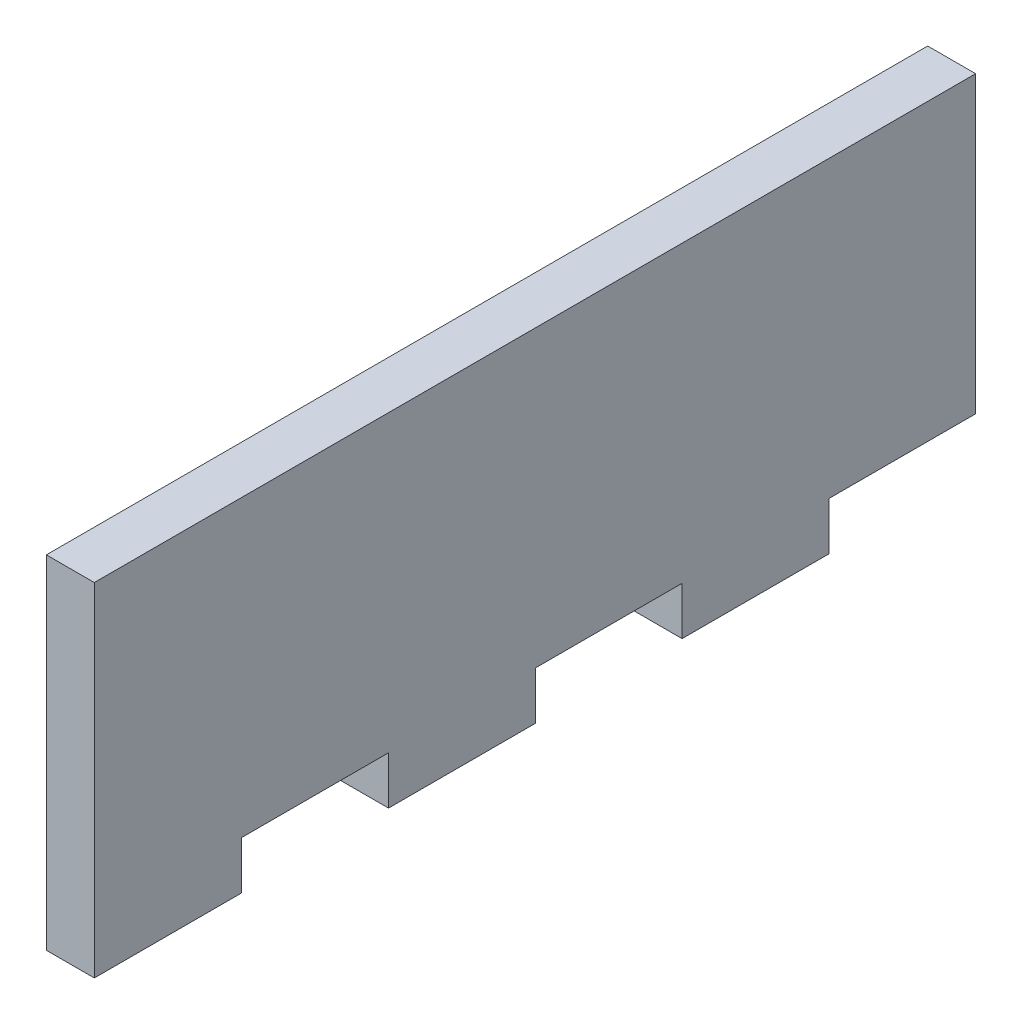
ISO-10303-21;
HEADER;
FILE_DESCRIPTION(('STEP AP214'),'2;1');
FILE_NAME('part.step','',(''),(''),'','','');
FILE_SCHEMA(('AUTOMOTIVE_DESIGN { 1 0 10303 214 1 1 1 1 }'));
ENDSEC;
DATA;
#1=APPLICATION_CONTEXT('core data for automotive mechanical design processes');
#2=APPLICATION_PROTOCOL_DEFINITION('international standard','automotive_design',2000,#1);
#3=PRODUCT_CONTEXT('',#1,'mechanical');
#4=PRODUCT('Part','Part','',(#3));
#5=PRODUCT_RELATED_PRODUCT_CATEGORY('part','',(#4));
#6=PRODUCT_DEFINITION_FORMATION('','',#4);
#7=PRODUCT_DEFINITION_CONTEXT('part definition',#1,'design');
#8=PRODUCT_DEFINITION('design','',#6,#7);
#9=PRODUCT_DEFINITION_SHAPE('','',#8);
#10=(LENGTH_UNIT() NAMED_UNIT(*) SI_UNIT(.MILLI.,.METRE.));
#11=(NAMED_UNIT(*) PLANE_ANGLE_UNIT() SI_UNIT($,.RADIAN.));
#12=(NAMED_UNIT(*) SI_UNIT($,.STERADIAN.) SOLID_ANGLE_UNIT());
#13=UNCERTAINTY_MEASURE_WITH_UNIT(LENGTH_MEASURE(1.E-05),#10,'distance_accuracy_value','');
#14=(GEOMETRIC_REPRESENTATION_CONTEXT(3) GLOBAL_UNCERTAINTY_ASSIGNED_CONTEXT((#13)) GLOBAL_UNIT_ASSIGNED_CONTEXT((#10,
#11,#12)) REPRESENTATION_CONTEXT('',''));
#15=CARTESIAN_POINT('',(0.,0.,0.));
#16=DIRECTION('',(0.,0.,1.));
#17=DIRECTION('',(1.,0.,0.));
#18=AXIS2_PLACEMENT_3D('',#15,#16,#17);
#19=CARTESIAN_POINT('',(5.334,-19.05,57.15));
#20=DIRECTION('',(0.,1.,0.));
#21=DIRECTION('',(0.,0.,1.));
#22=AXIS2_PLACEMENT_3D('',#19,#20,#21);
#23=PLANE('',#22);
#24=DIRECTION('',(1.,0.,0.));
#25=VECTOR('',#24,1.);
#26=CARTESIAN_POINT('',(0.,-19.05,40.7488571428571));
#27=LINE('',#26,#25);
#28=CARTESIAN_POINT('',(0.,-19.05,40.7488571428571));
#29=VERTEX_POINT('',#28);
#30=CARTESIAN_POINT('',(5.33399999999999,-19.05,40.7488571428571));
#31=VERTEX_POINT('',#30);
#32=EDGE_CURVE('E211',#29,#31,#27,.T.);
#33=ORIENTED_EDGE('',*,*,#32,.T.);
#34=DIRECTION('',(0.,0.,-1.));
#35=VECTOR('',#34,1.);
#36=CARTESIAN_POINT('',(5.334,-19.05,57.15));
#37=LINE('',#36,#35);
#38=CARTESIAN_POINT('',(5.334,-19.05,57.15));
#39=VERTEX_POINT('',#38);
#40=EDGE_CURVE('E187',#39,#31,#37,.T.);
#41=ORIENTED_EDGE('',*,*,#40,.F.);
#42=DIRECTION('',(-1.,0.,0.));
#43=VECTOR('',#42,1.);
#44=CARTESIAN_POINT('',(5.334,-19.05,57.15));
#45=LINE('',#44,#43);
#46=CARTESIAN_POINT('',(0.,-19.05,57.15));
#47=VERTEX_POINT('',#46);
#48=EDGE_CURVE('E41',#39,#47,#45,.T.);
#49=ORIENTED_EDGE('',*,*,#48,.T.);
#50=DIRECTION('',(0.,0.,-1.));
#51=VECTOR('',#50,1.);
#52=CARTESIAN_POINT('',(0.,-19.05,57.15));
#53=LINE('',#52,#51);
#54=EDGE_CURVE('E184',#47,#29,#53,.T.);
#55=ORIENTED_EDGE('',*,*,#54,.T.);
#56=EDGE_LOOP('',(#33,#41,#49,#55));
#57=FACE_BOUND('',#56,.T.);
#58=ADVANCED_FACE('F33',(#57),#23,.F.);
#59=DIRECTION('',(-1.,0.,0.));
#60=VECTOR('',#59,1.);
#61=CARTESIAN_POINT('',(0.,-19.05,24.4202857142857));
#62=LINE('',#61,#60);
#63=CARTESIAN_POINT('',(5.33399999999999,-19.05,24.4202857142857));
#64=VERTEX_POINT('',#63);
#65=CARTESIAN_POINT('',(0.,-19.05,24.4202857142857));
#66=VERTEX_POINT('',#65);
#67=EDGE_CURVE('E230',#64,#66,#62,.T.);
#68=ORIENTED_EDGE('',*,*,#67,.T.);
#69=CARTESIAN_POINT('',(0.,-19.05,8.09171428571425));
#70=VERTEX_POINT('',#69);
#71=EDGE_CURVE('E195',#66,#70,#53,.T.);
#72=ORIENTED_EDGE('',*,*,#71,.T.);
#73=DIRECTION('',(1.,0.,0.));
#74=VECTOR('',#73,1.);
#75=CARTESIAN_POINT('',(0.,-19.05,8.09171428571425));
#76=LINE('',#75,#74);
#77=CARTESIAN_POINT('',(5.33399999999999,-19.05,8.09171428571425));
#78=VERTEX_POINT('',#77);
#79=EDGE_CURVE('E226',#70,#78,#76,.T.);
#80=ORIENTED_EDGE('',*,*,#79,.T.);
#81=EDGE_CURVE('E189',#64,#78,#37,.T.);
#82=ORIENTED_EDGE('',*,*,#81,.F.);
#83=EDGE_LOOP('',(#68,#72,#80,#82));
#84=FACE_BOUND('',#83,.T.);
#85=ADVANCED_FACE('F253',(#84),#23,.F.);
#86=DIRECTION('',(-1.,0.,0.));
#87=VECTOR('',#86,1.);
#88=CARTESIAN_POINT('',(0.,-19.05,-8.23685714285717));
#89=LINE('',#88,#87);
#90=CARTESIAN_POINT('',(5.33399999999998,-19.05,-8.23685714285718));
#91=VERTEX_POINT('',#90);
#92=CARTESIAN_POINT('',(0.,-19.05,-8.23685714285717));
#93=VERTEX_POINT('',#92);
#94=EDGE_CURVE('E242',#91,#93,#89,.T.);
#95=ORIENTED_EDGE('',*,*,#94,.T.);
#96=CARTESIAN_POINT('',(0.,-19.05,-24.5654285714286));
#97=VERTEX_POINT('',#96);
#98=EDGE_CURVE('E193',#93,#97,#53,.T.);
#99=ORIENTED_EDGE('',*,*,#98,.T.);
#100=DIRECTION('',(1.,0.,0.));
#101=VECTOR('',#100,1.);
#102=CARTESIAN_POINT('',(0.,-19.05,-24.5654285714286));
#103=LINE('',#102,#101);
#104=CARTESIAN_POINT('',(5.33399999999998,-19.05,-24.5654285714286));
#105=VERTEX_POINT('',#104);
#106=EDGE_CURVE('E152',#97,#105,#103,.T.);
#107=ORIENTED_EDGE('',*,*,#106,.T.);
#108=EDGE_CURVE('E186',#91,#105,#37,.T.);
#109=ORIENTED_EDGE('',*,*,#108,.F.);
#110=EDGE_LOOP('',(#95,#99,#107,#109));
#111=FACE_BOUND('',#110,.T.);
#112=ADVANCED_FACE('F266',(#111),#23,.F.);
#113=CARTESIAN_POINT('',(0.,19.05,-57.15));
#114=DIRECTION('',(-1.,0.,0.));
#115=DIRECTION('',(0.,0.,1.));
#116=AXIS2_PLACEMENT_3D('',#113,#114,#115);
#117=PLANE('',#116);
#118=DIRECTION('',(0.,0.,-1.));
#119=VECTOR('',#118,1.);
#120=CARTESIAN_POINT('',(0.,-13.716,-40.894));
#121=LINE('',#120,#119);
#122=CARTESIAN_POINT('',(0.,-13.716,40.7488571428571));
#123=VERTEX_POINT('',#122);
#124=CARTESIAN_POINT('',(0.,-13.716,24.4202857142857));
#125=VERTEX_POINT('',#124);
#126=EDGE_CURVE('E48',#123,#125,#121,.T.);
#127=ORIENTED_EDGE('',*,*,#126,.F.);
#128=DIRECTION('',(0.,-1.,0.));
#129=VECTOR('',#128,1.);
#130=CARTESIAN_POINT('',(0.,-13.716,40.7488571428571));
#131=LINE('',#130,#129);
#132=EDGE_CURVE('E165',#123,#29,#131,.T.);
#133=ORIENTED_EDGE('',*,*,#132,.T.);
#134=ORIENTED_EDGE('',*,*,#54,.F.);
#135=DIRECTION('',(0.,-1.,0.));
#136=VECTOR('',#135,1.);
#137=CARTESIAN_POINT('',(0.,-19.05,57.15));
#138=LINE('',#137,#136);
#139=CARTESIAN_POINT('',(0.,19.05,57.15));
#140=VERTEX_POINT('',#139);
#141=EDGE_CURVE('E191',#140,#47,#138,.T.);
#142=ORIENTED_EDGE('',*,*,#141,.F.);
#143=DIRECTION('',(0.,0.,1.));
#144=VECTOR('',#143,1.);
#145=CARTESIAN_POINT('',(0.,19.05,57.15));
#146=LINE('',#145,#144);
#147=CARTESIAN_POINT('',(0.,19.05,-40.894));
#148=VERTEX_POINT('',#147);
#149=EDGE_CURVE('E180',#148,#140,#146,.T.);
#150=ORIENTED_EDGE('',*,*,#149,.F.);
#151=DIRECTION('',(0.,-1.,0.));
#152=VECTOR('',#151,1.);
#153=CARTESIAN_POINT('',(0.,-19.05,-40.894));
#154=LINE('',#153,#152);
#155=CARTESIAN_POINT('',(0.,-13.716,-40.894));
#156=VERTEX_POINT('',#155);
#157=EDGE_CURVE('E161',#148,#156,#154,.T.);
#158=ORIENTED_EDGE('',*,*,#157,.T.);
#159=CARTESIAN_POINT('',(0.,-13.716,-24.5654285714286));
#160=VERTEX_POINT('',#159);
#161=EDGE_CURVE('E139',#160,#156,#121,.T.);
#162=ORIENTED_EDGE('',*,*,#161,.F.);
#163=DIRECTION('',(0.,-1.,0.));
#164=VECTOR('',#163,1.);
#165=CARTESIAN_POINT('',(0.,-13.716,-24.5654285714286));
#166=LINE('',#165,#164);
#167=EDGE_CURVE('E149',#160,#97,#166,.T.);
#168=ORIENTED_EDGE('',*,*,#167,.T.);
#169=ORIENTED_EDGE('',*,*,#98,.F.);
#170=DIRECTION('',(0.,-1.,0.));
#171=VECTOR('',#170,1.);
#172=CARTESIAN_POINT('',(0.,-13.716,-8.23685714285717));
#173=LINE('',#172,#171);
#174=CARTESIAN_POINT('',(0.,-13.716,-8.23685714285717));
#175=VERTEX_POINT('',#174);
#176=EDGE_CURVE('E145',#175,#93,#173,.T.);
#177=ORIENTED_EDGE('',*,*,#176,.F.);
#178=CARTESIAN_POINT('',(0.,-13.716,8.09171428571425));
#179=VERTEX_POINT('',#178);
#180=EDGE_CURVE('E56',#179,#175,#121,.T.);
#181=ORIENTED_EDGE('',*,*,#180,.F.);
#182=DIRECTION('',(0.,-1.,0.));
#183=VECTOR('',#182,1.);
#184=CARTESIAN_POINT('',(0.,-13.716,8.09171428571425));
#185=LINE('',#184,#183);
#186=EDGE_CURVE('E218',#179,#70,#185,.T.);
#187=ORIENTED_EDGE('',*,*,#186,.T.);
#188=ORIENTED_EDGE('',*,*,#71,.F.);
#189=DIRECTION('',(0.,-1.,0.));
#190=VECTOR('',#189,1.);
#191=CARTESIAN_POINT('',(0.,-13.716,24.4202857142857));
#192=LINE('',#191,#190);
#193=EDGE_CURVE('E216',#125,#66,#192,.T.);
#194=ORIENTED_EDGE('',*,*,#193,.F.);
#195=EDGE_LOOP('',(#127,#133,#134,#142,#150,#158,#162,#168,#169,#177,#181,#187,#188,#194));
#196=FACE_BOUND('',#195,.T.);
#197=ADVANCED_FACE('F159',(#196),#117,.T.);
#198=CARTESIAN_POINT('',(5.334,19.05,57.15));
#199=DIRECTION('',(0.,-1.,0.));
#200=DIRECTION('',(0.,0.,-1.));
#201=AXIS2_PLACEMENT_3D('',#198,#199,#200);
#202=PLANE('',#201);
#203=DIRECTION('',(0.,0.,1.));
#204=VECTOR('',#203,1.);
#205=CARTESIAN_POINT('',(5.334,19.05,57.15));
#206=LINE('',#205,#204);
#207=CARTESIAN_POINT('',(5.334,19.05,-40.894));
#208=VERTEX_POINT('',#207);
#209=CARTESIAN_POINT('',(5.334,19.05,57.15));
#210=VERTEX_POINT('',#209);
#211=EDGE_CURVE('E181',#208,#210,#206,.T.);
#212=ORIENTED_EDGE('',*,*,#211,.F.);
#213=DIRECTION('',(1.,0.,0.));
#214=VECTOR('',#213,1.);
#215=CARTESIAN_POINT('',(0.,19.05,-40.894));
#216=LINE('',#215,#214);
#217=EDGE_CURVE('E175',#148,#208,#216,.T.);
#218=ORIENTED_EDGE('',*,*,#217,.F.);
#219=ORIENTED_EDGE('',*,*,#149,.T.);
#220=DIRECTION('',(-1.,0.,0.));
#221=VECTOR('',#220,1.);
#222=CARTESIAN_POINT('',(5.334,19.05,57.15));
#223=LINE('',#222,#221);
#224=EDGE_CURVE('E11',#210,#140,#223,.T.);
#225=ORIENTED_EDGE('',*,*,#224,.F.);
#226=EDGE_LOOP('',(#212,#218,#219,#225));
#227=FACE_BOUND('',#226,.T.);
#228=ADVANCED_FACE('F35',(#227),#202,.F.);
#229=CARTESIAN_POINT('',(5.334,-19.05,57.15));
#230=DIRECTION('',(0.,0.,-1.));
#231=DIRECTION('',(-1.,0.,0.));
#232=AXIS2_PLACEMENT_3D('',#229,#230,#231);
#233=PLANE('',#232);
#234=ORIENTED_EDGE('',*,*,#141,.T.);
#235=ORIENTED_EDGE('',*,*,#48,.F.);
#236=DIRECTION('',(0.,-1.,0.));
#237=VECTOR('',#236,1.);
#238=CARTESIAN_POINT('',(5.334,-19.05,57.15));
#239=LINE('',#238,#237);
#240=EDGE_CURVE('E183',#210,#39,#239,.T.);
#241=ORIENTED_EDGE('',*,*,#240,.F.);
#242=ORIENTED_EDGE('',*,*,#224,.T.);
#243=EDGE_LOOP('',(#234,#235,#241,#242));
#244=FACE_BOUND('',#243,.T.);
#245=ADVANCED_FACE('F304',(#244),#233,.F.);
#246=CARTESIAN_POINT('',(5.334,19.05,-57.15));
#247=DIRECTION('',(-1.,0.,0.));
#248=DIRECTION('',(0.,0.,1.));
#249=AXIS2_PLACEMENT_3D('',#246,#247,#248);
#250=PLANE('',#249);
#251=DIRECTION('',(0.,-1.,0.));
#252=VECTOR('',#251,1.);
#253=CARTESIAN_POINT('',(5.33399999999999,-13.716,40.7488571428571));
#254=LINE('',#253,#252);
#255=CARTESIAN_POINT('',(5.334,-13.716,40.7488571428571));
#256=VERTEX_POINT('',#255);
#257=EDGE_CURVE('E162',#256,#31,#254,.T.);
#258=ORIENTED_EDGE('',*,*,#257,.F.);
#259=DIRECTION('',(0.,0.,-1.));
#260=VECTOR('',#259,1.);
#261=CARTESIAN_POINT('',(5.334,-13.716,-57.15));
#262=LINE('',#261,#260);
#263=CARTESIAN_POINT('',(5.33399999999999,-13.716,24.4202857142857));
#264=VERTEX_POINT('',#263);
#265=EDGE_CURVE('E172',#256,#264,#262,.T.);
#266=ORIENTED_EDGE('',*,*,#265,.T.);
#267=DIRECTION('',(0.,-1.,0.));
#268=VECTOR('',#267,1.);
#269=CARTESIAN_POINT('',(5.33399999999999,-13.716,24.4202857142857));
#270=LINE('',#269,#268);
#271=EDGE_CURVE('E214',#264,#64,#270,.T.);
#272=ORIENTED_EDGE('',*,*,#271,.T.);
#273=ORIENTED_EDGE('',*,*,#81,.T.);
#274=DIRECTION('',(0.,-1.,0.));
#275=VECTOR('',#274,1.);
#276=CARTESIAN_POINT('',(5.33399999999999,-13.716,8.09171428571425));
#277=LINE('',#276,#275);
#278=CARTESIAN_POINT('',(5.334,-13.716,8.09171428571425));
#279=VERTEX_POINT('',#278);
#280=EDGE_CURVE('E222',#279,#78,#277,.T.);
#281=ORIENTED_EDGE('',*,*,#280,.F.);
#282=CARTESIAN_POINT('',(5.33399999999999,-13.716,-8.23685714285718));
#283=VERTEX_POINT('',#282);
#284=EDGE_CURVE('E170',#279,#283,#262,.T.);
#285=ORIENTED_EDGE('',*,*,#284,.T.);
#286=DIRECTION('',(0.,-1.,0.));
#287=VECTOR('',#286,1.);
#288=CARTESIAN_POINT('',(5.33399999999999,-13.716,-8.23685714285718));
#289=LINE('',#288,#287);
#290=EDGE_CURVE('E233',#283,#91,#289,.T.);
#291=ORIENTED_EDGE('',*,*,#290,.T.);
#292=ORIENTED_EDGE('',*,*,#108,.T.);
#293=DIRECTION('',(0.,-1.,0.));
#294=VECTOR('',#293,1.);
#295=CARTESIAN_POINT('',(5.33399999999998,-13.716,-24.5654285714286));
#296=LINE('',#295,#294);
#297=CARTESIAN_POINT('',(5.33399999999999,-13.716,-24.5654285714286));
#298=VERTEX_POINT('',#297);
#299=EDGE_CURVE('E156',#298,#105,#296,.T.);
#300=ORIENTED_EDGE('',*,*,#299,.F.);
#301=CARTESIAN_POINT('',(5.334,-13.716,-40.894));
#302=VERTEX_POINT('',#301);
#303=EDGE_CURVE('E142',#298,#302,#262,.T.);
#304=ORIENTED_EDGE('',*,*,#303,.T.);
#305=DIRECTION('',(0.,-1.,0.));
#306=VECTOR('',#305,1.);
#307=CARTESIAN_POINT('',(5.334,-19.05,-40.894));
#308=LINE('',#307,#306);
#309=EDGE_CURVE('E176',#208,#302,#308,.T.);
#310=ORIENTED_EDGE('',*,*,#309,.F.);
#311=ORIENTED_EDGE('',*,*,#211,.T.);
#312=ORIENTED_EDGE('',*,*,#240,.T.);
#313=ORIENTED_EDGE('',*,*,#40,.T.);
#314=EDGE_LOOP('',(#258,#266,#272,#273,#281,#285,#291,#292,#300,#304,#310,#311,#312,#313));
#315=FACE_BOUND('',#314,.T.);
#316=ADVANCED_FACE('F262',(#315),#250,.F.);
#317=CARTESIAN_POINT('',(0.,-19.05,-40.894));
#318=DIRECTION('',(0.,0.,1.));
#319=DIRECTION('',(1.,0.,0.));
#320=AXIS2_PLACEMENT_3D('',#317,#318,#319);
#321=PLANE('',#320);
#322=ORIENTED_EDGE('',*,*,#309,.T.);
#323=DIRECTION('',(1.,0.,0.));
#324=VECTOR('',#323,1.);
#325=CARTESIAN_POINT('',(0.,-13.716,-40.894));
#326=LINE('',#325,#324);
#327=EDGE_CURVE('E169',#156,#302,#326,.T.);
#328=ORIENTED_EDGE('',*,*,#327,.F.);
#329=ORIENTED_EDGE('',*,*,#157,.F.);
#330=ORIENTED_EDGE('',*,*,#217,.T.);
#331=EDGE_LOOP('',(#322,#328,#329,#330));
#332=FACE_BOUND('',#331,.T.);
#333=ADVANCED_FACE('F303',(#332),#321,.F.);
#334=CARTESIAN_POINT('',(88.9,-13.716,73.4059999999999));
#335=DIRECTION('',(0.,1.,0.));
#336=DIRECTION('',(0.,0.,1.));
#337=AXIS2_PLACEMENT_3D('',#334,#335,#336);
#338=PLANE('',#337);
#339=DIRECTION('',(1.,0.,0.));
#340=VECTOR('',#339,1.);
#341=CARTESIAN_POINT('',(0.,-13.716,-24.5654285714286));
#342=LINE('',#341,#340);
#343=EDGE_CURVE('E135',#160,#298,#342,.T.);
#344=ORIENTED_EDGE('',*,*,#343,.F.);
#345=ORIENTED_EDGE('',*,*,#161,.T.);
#346=ORIENTED_EDGE('',*,*,#327,.T.);
#347=ORIENTED_EDGE('',*,*,#303,.F.);
#348=EDGE_LOOP('',(#344,#345,#346,#347));
#349=FACE_BOUND('',#348,.T.);
#350=ADVANCED_FACE('F137',(#349),#338,.F.);
#351=CARTESIAN_POINT('',(0.,-13.716,-24.5654285714286));
#352=DIRECTION('',(0.,0.,-1.));
#353=DIRECTION('',(1.,0.,0.));
#354=AXIS2_PLACEMENT_3D('',#351,#352,#353);
#355=PLANE('',#354);
#356=ORIENTED_EDGE('',*,*,#106,.F.);
#357=ORIENTED_EDGE('',*,*,#167,.F.);
#358=ORIENTED_EDGE('',*,*,#343,.T.);
#359=ORIENTED_EDGE('',*,*,#299,.T.);
#360=EDGE_LOOP('',(#356,#357,#358,#359));
#361=FACE_BOUND('',#360,.T.);
#362=ADVANCED_FACE('F150',(#361),#355,.T.);
#363=CARTESIAN_POINT('',(0.,-13.716,-8.23685714285717));
#364=DIRECTION('',(0.,0.,1.));
#365=DIRECTION('',(-1.,0.,0.));
#366=AXIS2_PLACEMENT_3D('',#363,#364,#365);
#367=PLANE('',#366);
#368=ORIENTED_EDGE('',*,*,#94,.F.);
#369=ORIENTED_EDGE('',*,*,#290,.F.);
#370=DIRECTION('',(-1.,0.,0.));
#371=VECTOR('',#370,1.);
#372=CARTESIAN_POINT('',(0.,-13.716,-8.23685714285717));
#373=LINE('',#372,#371);
#374=EDGE_CURVE('E146',#283,#175,#373,.T.);
#375=ORIENTED_EDGE('',*,*,#374,.T.);
#376=ORIENTED_EDGE('',*,*,#176,.T.);
#377=EDGE_LOOP('',(#368,#369,#375,#376));
#378=FACE_BOUND('',#377,.T.);
#379=ADVANCED_FACE('F247',(#378),#367,.T.);
#380=CARTESIAN_POINT('',(0.,-13.716,8.09171428571425));
#381=DIRECTION('',(0.,0.,-1.));
#382=DIRECTION('',(1.,0.,0.));
#383=AXIS2_PLACEMENT_3D('',#380,#381,#382);
#384=PLANE('',#383);
#385=ORIENTED_EDGE('',*,*,#79,.F.);
#386=ORIENTED_EDGE('',*,*,#186,.F.);
#387=DIRECTION('',(1.,0.,0.));
#388=VECTOR('',#387,1.);
#389=CARTESIAN_POINT('',(0.,-13.716,8.09171428571425));
#390=LINE('',#389,#388);
#391=EDGE_CURVE('E219',#179,#279,#390,.T.);
#392=ORIENTED_EDGE('',*,*,#391,.T.);
#393=ORIENTED_EDGE('',*,*,#280,.T.);
#394=EDGE_LOOP('',(#385,#386,#392,#393));
#395=FACE_BOUND('',#394,.T.);
#396=ADVANCED_FACE('F258',(#395),#384,.T.);
#397=ORIENTED_EDGE('',*,*,#391,.F.);
#398=ORIENTED_EDGE('',*,*,#180,.T.);
#399=ORIENTED_EDGE('',*,*,#374,.F.);
#400=ORIENTED_EDGE('',*,*,#284,.F.);
#401=EDGE_LOOP('',(#397,#398,#399,#400));
#402=FACE_BOUND('',#401,.T.);
#403=ADVANCED_FACE('F325',(#402),#338,.F.);
#404=DIRECTION('',(1.,0.,0.));
#405=VECTOR('',#404,1.);
#406=CARTESIAN_POINT('',(0.,-13.716,40.7488571428571));
#407=LINE('',#406,#405);
#408=EDGE_CURVE('E210',#123,#256,#407,.T.);
#409=ORIENTED_EDGE('',*,*,#408,.F.);
#410=ORIENTED_EDGE('',*,*,#126,.T.);
#411=DIRECTION('',(-1.,0.,0.));
#412=VECTOR('',#411,1.);
#413=CARTESIAN_POINT('',(0.,-13.716,24.4202857142857));
#414=LINE('',#413,#412);
#415=EDGE_CURVE('E229',#264,#125,#414,.T.);
#416=ORIENTED_EDGE('',*,*,#415,.F.);
#417=ORIENTED_EDGE('',*,*,#265,.F.);
#418=EDGE_LOOP('',(#409,#410,#416,#417));
#419=FACE_BOUND('',#418,.T.);
#420=ADVANCED_FACE('F324',(#419),#338,.F.);
#421=CARTESIAN_POINT('',(0.,-13.716,40.7488571428571));
#422=DIRECTION('',(0.,0.,-1.));
#423=DIRECTION('',(1.,0.,0.));
#424=AXIS2_PLACEMENT_3D('',#421,#422,#423);
#425=PLANE('',#424);
#426=ORIENTED_EDGE('',*,*,#32,.F.);
#427=ORIENTED_EDGE('',*,*,#132,.F.);
#428=ORIENTED_EDGE('',*,*,#408,.T.);
#429=ORIENTED_EDGE('',*,*,#257,.T.);
#430=EDGE_LOOP('',(#426,#427,#428,#429));
#431=FACE_BOUND('',#430,.T.);
#432=ADVANCED_FACE('F368',(#431),#425,.T.);
#433=CARTESIAN_POINT('',(0.,-13.716,24.4202857142857));
#434=DIRECTION('',(0.,0.,1.));
#435=DIRECTION('',(-1.,0.,0.));
#436=AXIS2_PLACEMENT_3D('',#433,#434,#435);
#437=PLANE('',#436);
#438=ORIENTED_EDGE('',*,*,#67,.F.);
#439=ORIENTED_EDGE('',*,*,#271,.F.);
#440=ORIENTED_EDGE('',*,*,#415,.T.);
#441=ORIENTED_EDGE('',*,*,#193,.T.);
#442=EDGE_LOOP('',(#438,#439,#440,#441));
#443=FACE_BOUND('',#442,.T.);
#444=ADVANCED_FACE('F377',(#443),#437,.T.);
#445=CLOSED_SHELL('',(#58,#85,#112,#197,#228,#245,#316,#333,#350,#362,#379,#396,#403,#420,#432,#444));
#446=MANIFOLD_SOLID_BREP('B2',#445);
#447=ADVANCED_BREP_SHAPE_REPRESENTATION('',(#18,#446),#14);
#448=SHAPE_DEFINITION_REPRESENTATION(#9,#447);
ENDSEC;
END-ISO-10303-21;
